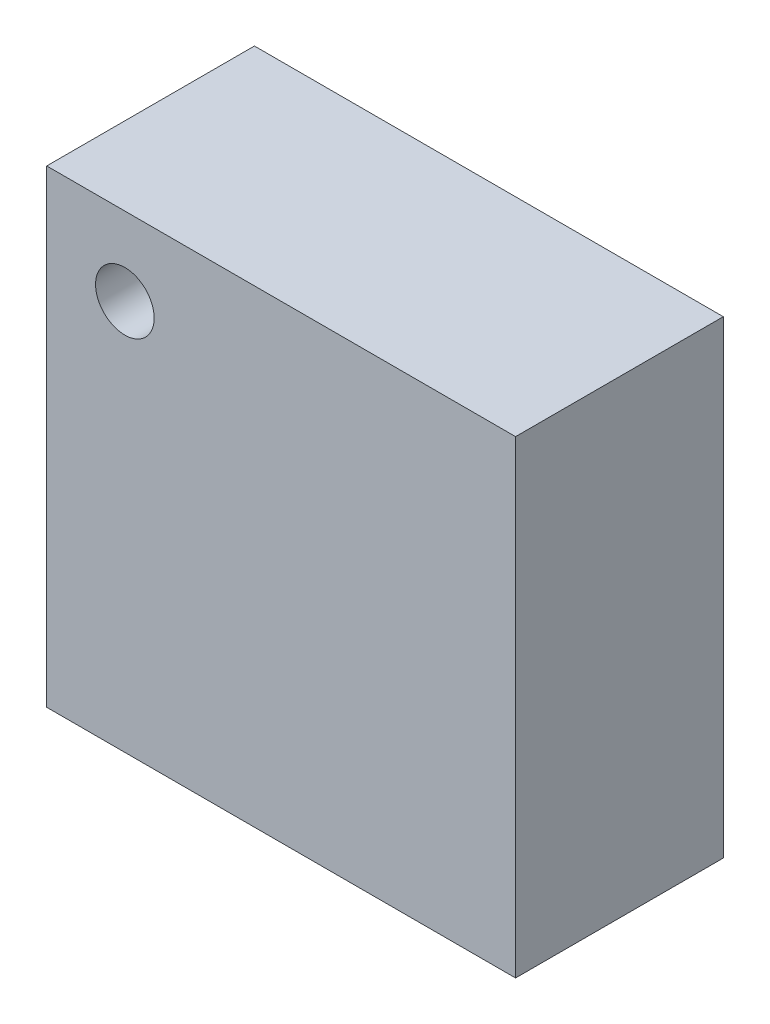
ISO-10303-21;
HEADER;
FILE_DESCRIPTION(('STEP AP214'),'2;1');
FILE_NAME('part.step','',(''),(''),'','','');
FILE_SCHEMA(('AUTOMOTIVE_DESIGN { 1 0 10303 214 1 1 1 1 }'));
ENDSEC;
DATA;
#1=APPLICATION_CONTEXT('core data for automotive mechanical design processes');
#2=APPLICATION_PROTOCOL_DEFINITION('international standard','automotive_design',2000,#1);
#3=PRODUCT_CONTEXT('',#1,'mechanical');
#4=PRODUCT('Part','Part','',(#3));
#5=PRODUCT_RELATED_PRODUCT_CATEGORY('part','',(#4));
#6=PRODUCT_DEFINITION_FORMATION('','',#4);
#7=PRODUCT_DEFINITION_CONTEXT('part definition',#1,'design');
#8=PRODUCT_DEFINITION('design','',#6,#7);
#9=PRODUCT_DEFINITION_SHAPE('','',#8);
#10=(LENGTH_UNIT() NAMED_UNIT(*) SI_UNIT(.MILLI.,.METRE.));
#11=(NAMED_UNIT(*) PLANE_ANGLE_UNIT() SI_UNIT($,.RADIAN.));
#12=(NAMED_UNIT(*) SI_UNIT($,.STERADIAN.) SOLID_ANGLE_UNIT());
#13=UNCERTAINTY_MEASURE_WITH_UNIT(LENGTH_MEASURE(1.E-05),#10,'distance_accuracy_value','');
#14=(GEOMETRIC_REPRESENTATION_CONTEXT(3) GLOBAL_UNCERTAINTY_ASSIGNED_CONTEXT((#13)) GLOBAL_UNIT_ASSIGNED_CONTEXT((#10,
#11,#12)) REPRESENTATION_CONTEXT('',''));
#15=CARTESIAN_POINT('',(0.,0.,0.));
#16=DIRECTION('',(0.,0.,1.));
#17=DIRECTION('',(1.,0.,0.));
#18=AXIS2_PLACEMENT_3D('',#15,#16,#17);
#19=CARTESIAN_POINT('',(0.131666666667,0.658333333333,0.45));
#20=DIRECTION('',(0.,0.,1.));
#21=DIRECTION('',(1.,0.,0.));
#22=AXIS2_PLACEMENT_3D('',#19,#20,#21);
#23=PLANE('',#22);
#24=CARTESIAN_POINT('',(0.131666666667,0.658333333333,0.45));
#25=DIRECTION('',(0.,0.,1.));
#26=DIRECTION('',(1.,0.,0.));
#27=AXIS2_PLACEMENT_3D('',#24,#25,#26);
#28=CIRCLE('',#27,0.049375);
#29=CARTESIAN_POINT('',(0.082291666667,0.658333333333,0.45));
#30=VERTEX_POINT('',#29);
#31=EDGE_CURVE('E27',#30,#30,#28,.T.);
#32=ORIENTED_EDGE('',*,*,#31,.T.);
#33=EDGE_LOOP('',(#32));
#34=FACE_BOUND('',#33,.T.);
#35=ADVANCED_FACE('F16',(#34),#23,.T.);
#36=CARTESIAN_POINT('',(0.131666666667,0.658333333333,0.45));
#37=DIRECTION('',(0.,0.,1.));
#38=DIRECTION('',(1.,0.,0.));
#39=AXIS2_PLACEMENT_3D('',#36,#37,#38);
#40=CYLINDRICAL_SURFACE('',#39,0.049375);
#41=ORIENTED_EDGE('',*,*,#31,.F.);
#42=DIRECTION('',(0.,0.,1.));
#43=VECTOR('',#42,1.);
#44=CARTESIAN_POINT('',(0.082291666667,0.658333333333,0.45));
#45=LINE('',#44,#43);
#46=CARTESIAN_POINT('',(0.082291666667,0.658333333333,0.55));
#47=VERTEX_POINT('',#46);
#48=EDGE_CURVE('E11',#30,#47,#45,.T.);
#49=ORIENTED_EDGE('',*,*,#48,.T.);
#50=CARTESIAN_POINT('',(0.131666666667,0.658333333333,0.55));
#51=DIRECTION('',(0.,0.,1.));
#52=DIRECTION('',(1.,0.,0.));
#53=AXIS2_PLACEMENT_3D('',#50,#51,#52);
#54=CIRCLE('',#53,0.049375);
#55=EDGE_CURVE('E111',#47,#47,#54,.T.);
#56=ORIENTED_EDGE('',*,*,#55,.T.);
#57=ORIENTED_EDGE('',*,*,#48,.F.);
#58=EDGE_LOOP('',(#41,#49,#56,#57));
#59=FACE_BOUND('',#58,.T.);
#60=ADVANCED_FACE('F152',(#59),#40,.F.);
#61=CARTESIAN_POINT('',(0.79,0.,0.2));
#62=DIRECTION('',(1.,0.,0.));
#63=DIRECTION('',(0.,1.,0.));
#64=AXIS2_PLACEMENT_3D('',#61,#62,#63);
#65=PLANE('',#64);
#66=DIRECTION('',(0.,0.,1.));
#67=VECTOR('',#66,1.);
#68=CARTESIAN_POINT('',(0.79,0.,0.2));
#69=LINE('',#68,#67);
#70=CARTESIAN_POINT('',(0.79,0.,0.2));
#71=VERTEX_POINT('',#70);
#72=CARTESIAN_POINT('',(0.79,0.,0.55));
#73=VERTEX_POINT('',#72);
#74=EDGE_CURVE('E88',#71,#73,#69,.T.);
#75=ORIENTED_EDGE('',*,*,#74,.F.);
#76=DIRECTION('',(0.,1.,0.));
#77=VECTOR('',#76,1.);
#78=CARTESIAN_POINT('',(0.79,0.,0.2));
#79=LINE('',#78,#77);
#80=CARTESIAN_POINT('',(0.79,0.79,0.2));
#81=VERTEX_POINT('',#80);
#82=EDGE_CURVE('E116',#71,#81,#79,.T.);
#83=ORIENTED_EDGE('',*,*,#82,.T.);
#84=DIRECTION('',(0.,0.,1.));
#85=VECTOR('',#84,1.);
#86=CARTESIAN_POINT('',(0.79,0.79,0.2));
#87=LINE('',#86,#85);
#88=CARTESIAN_POINT('',(0.79,0.79,0.55));
#89=VERTEX_POINT('',#88);
#90=EDGE_CURVE('E114',#81,#89,#87,.T.);
#91=ORIENTED_EDGE('',*,*,#90,.T.);
#92=DIRECTION('',(0.,1.,0.));
#93=VECTOR('',#92,1.);
#94=CARTESIAN_POINT('',(0.79,0.,0.55));
#95=LINE('',#94,#93);
#96=EDGE_CURVE('E20',#73,#89,#95,.T.);
#97=ORIENTED_EDGE('',*,*,#96,.F.);
#98=EDGE_LOOP('',(#75,#83,#91,#97));
#99=FACE_BOUND('',#98,.T.);
#100=ADVANCED_FACE('F18',(#99),#65,.T.);
#101=CARTESIAN_POINT('',(0.,0.,0.2));
#102=DIRECTION('',(0.,0.,1.));
#103=DIRECTION('',(1.,0.,0.));
#104=AXIS2_PLACEMENT_3D('',#101,#102,#103);
#105=PLANE('',#104);
#106=DIRECTION('',(0.,1.,0.));
#107=VECTOR('',#106,1.);
#108=CARTESIAN_POINT('',(0.,0.,0.2));
#109=LINE('',#108,#107);
#110=CARTESIAN_POINT('',(0.,0.,0.2));
#111=VERTEX_POINT('',#110);
#112=CARTESIAN_POINT('',(0.,0.79,0.2));
#113=VERTEX_POINT('',#112);
#114=EDGE_CURVE('E102',#111,#113,#109,.T.);
#115=ORIENTED_EDGE('',*,*,#114,.T.);
#116=DIRECTION('',(1.,0.,0.));
#117=VECTOR('',#116,1.);
#118=CARTESIAN_POINT('',(0.,0.79,0.2));
#119=LINE('',#118,#117);
#120=EDGE_CURVE('E113',#113,#81,#119,.T.);
#121=ORIENTED_EDGE('',*,*,#120,.T.);
#122=ORIENTED_EDGE('',*,*,#82,.F.);
#123=DIRECTION('',(1.,0.,0.));
#124=VECTOR('',#123,1.);
#125=CARTESIAN_POINT('',(0.,0.,0.2));
#126=LINE('',#125,#124);
#127=EDGE_CURVE('E141',#111,#71,#126,.T.);
#128=ORIENTED_EDGE('',*,*,#127,.F.);
#129=EDGE_LOOP('',(#115,#121,#122,#128));
#130=FACE_BOUND('',#129,.T.);
#131=ADVANCED_FACE('F164',(#130),#105,.F.);
#132=CARTESIAN_POINT('',(0.,0.79,0.2));
#133=DIRECTION('',(0.,1.,0.));
#134=DIRECTION('',(1.,0.,0.));
#135=AXIS2_PLACEMENT_3D('',#132,#133,#134);
#136=PLANE('',#135);
#137=ORIENTED_EDGE('',*,*,#120,.F.);
#138=DIRECTION('',(0.,0.,1.));
#139=VECTOR('',#138,1.);
#140=CARTESIAN_POINT('',(0.,0.79,0.2));
#141=LINE('',#140,#139);
#142=CARTESIAN_POINT('',(0.,0.79,0.55));
#143=VERTEX_POINT('',#142);
#144=EDGE_CURVE('E97',#113,#143,#141,.T.);
#145=ORIENTED_EDGE('',*,*,#144,.T.);
#146=DIRECTION('',(1.,0.,0.));
#147=VECTOR('',#146,1.);
#148=CARTESIAN_POINT('',(0.,0.79,0.55));
#149=LINE('',#148,#147);
#150=EDGE_CURVE('E73',#143,#89,#149,.T.);
#151=ORIENTED_EDGE('',*,*,#150,.T.);
#152=ORIENTED_EDGE('',*,*,#90,.F.);
#153=EDGE_LOOP('',(#137,#145,#151,#152));
#154=FACE_BOUND('',#153,.T.);
#155=ADVANCED_FACE('F156',(#154),#136,.T.);
#156=CARTESIAN_POINT('',(0.,0.,0.55));
#157=DIRECTION('',(0.,0.,1.));
#158=DIRECTION('',(1.,0.,0.));
#159=AXIS2_PLACEMENT_3D('',#156,#157,#158);
#160=PLANE('',#159);
#161=ORIENTED_EDGE('',*,*,#55,.F.);
#162=EDGE_LOOP('',(#161));
#163=FACE_BOUND('',#162,.T.);
#164=DIRECTION('',(0.,1.,0.));
#165=VECTOR('',#164,1.);
#166=CARTESIAN_POINT('',(0.,0.,0.55));
#167=LINE('',#166,#165);
#168=CARTESIAN_POINT('',(0.,0.,0.55));
#169=VERTEX_POINT('',#168);
#170=EDGE_CURVE('E92',#169,#143,#167,.T.);
#171=ORIENTED_EDGE('',*,*,#170,.F.);
#172=DIRECTION('',(1.,0.,0.));
#173=VECTOR('',#172,1.);
#174=CARTESIAN_POINT('',(0.,0.,0.55));
#175=LINE('',#174,#173);
#176=EDGE_CURVE('E82',#169,#73,#175,.T.);
#177=ORIENTED_EDGE('',*,*,#176,.T.);
#178=ORIENTED_EDGE('',*,*,#96,.T.);
#179=ORIENTED_EDGE('',*,*,#150,.F.);
#180=EDGE_LOOP('',(#171,#177,#178,#179));
#181=FACE_BOUND('',#180,.T.);
#182=ADVANCED_FACE('F93',(#163,#181),#160,.T.);
#183=CARTESIAN_POINT('',(0.,0.,0.2));
#184=DIRECTION('',(0.,1.,0.));
#185=DIRECTION('',(1.,0.,0.));
#186=AXIS2_PLACEMENT_3D('',#183,#184,#185);
#187=PLANE('',#186);
#188=ORIENTED_EDGE('',*,*,#127,.T.);
#189=ORIENTED_EDGE('',*,*,#74,.T.);
#190=ORIENTED_EDGE('',*,*,#176,.F.);
#191=DIRECTION('',(0.,0.,1.));
#192=VECTOR('',#191,1.);
#193=CARTESIAN_POINT('',(0.,0.,0.2));
#194=LINE('',#193,#192);
#195=EDGE_CURVE('E86',#111,#169,#194,.T.);
#196=ORIENTED_EDGE('',*,*,#195,.F.);
#197=EDGE_LOOP('',(#188,#189,#190,#196));
#198=FACE_BOUND('',#197,.T.);
#199=ADVANCED_FACE('F84',(#198),#187,.F.);
#200=CARTESIAN_POINT('',(0.,0.,0.2));
#201=DIRECTION('',(1.,0.,0.));
#202=DIRECTION('',(0.,1.,0.));
#203=AXIS2_PLACEMENT_3D('',#200,#201,#202);
#204=PLANE('',#203);
#205=ORIENTED_EDGE('',*,*,#195,.T.);
#206=ORIENTED_EDGE('',*,*,#170,.T.);
#207=ORIENTED_EDGE('',*,*,#144,.F.);
#208=ORIENTED_EDGE('',*,*,#114,.F.);
#209=EDGE_LOOP('',(#205,#206,#207,#208));
#210=FACE_BOUND('',#209,.T.);
#211=ADVANCED_FACE('F100',(#210),#204,.F.);
#212=CLOSED_SHELL('',(#35,#60,#100,#131,#155,#182,#199,#211));
#213=MANIFOLD_SOLID_BREP('B1',#212);
#214=ADVANCED_BREP_SHAPE_REPRESENTATION('',(#18,#213),#14);
#215=SHAPE_DEFINITION_REPRESENTATION(#9,#214);
ENDSEC;
END-ISO-10303-21;
